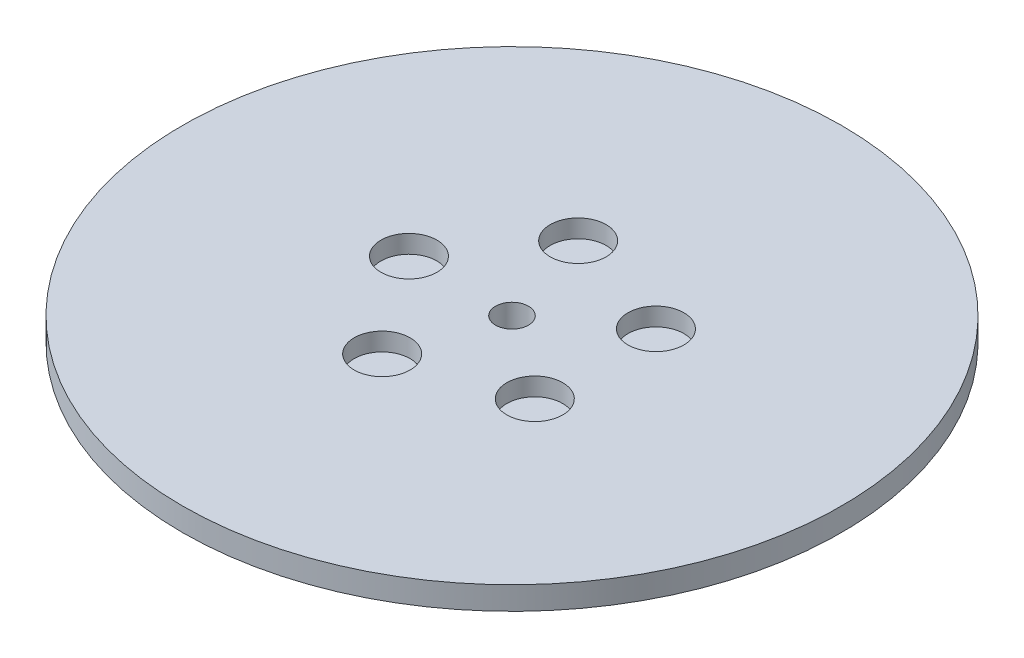
ISO-10303-21;
HEADER;
FILE_DESCRIPTION(('STEP AP214'),'2;1');
FILE_NAME('part.step','',(''),(''),'','','');
FILE_SCHEMA(('AUTOMOTIVE_DESIGN { 1 0 10303 214 1 1 1 1 }'));
ENDSEC;
DATA;
#1=APPLICATION_CONTEXT('core data for automotive mechanical design processes');
#2=APPLICATION_PROTOCOL_DEFINITION('international standard','automotive_design',2000,#1);
#3=PRODUCT_CONTEXT('',#1,'mechanical');
#4=PRODUCT('Part','Part','',(#3));
#5=PRODUCT_RELATED_PRODUCT_CATEGORY('part','',(#4));
#6=PRODUCT_DEFINITION_FORMATION('','',#4);
#7=PRODUCT_DEFINITION_CONTEXT('part definition',#1,'design');
#8=PRODUCT_DEFINITION('design','',#6,#7);
#9=PRODUCT_DEFINITION_SHAPE('','',#8);
#10=(LENGTH_UNIT() NAMED_UNIT(*) SI_UNIT(.MILLI.,.METRE.));
#11=(NAMED_UNIT(*) PLANE_ANGLE_UNIT() SI_UNIT($,.RADIAN.));
#12=(NAMED_UNIT(*) SI_UNIT($,.STERADIAN.) SOLID_ANGLE_UNIT());
#13=UNCERTAINTY_MEASURE_WITH_UNIT(LENGTH_MEASURE(1.E-05),#10,'distance_accuracy_value','');
#14=(GEOMETRIC_REPRESENTATION_CONTEXT(3) GLOBAL_UNCERTAINTY_ASSIGNED_CONTEXT((#13)) GLOBAL_UNIT_ASSIGNED_CONTEXT((#10,
#11,#12)) REPRESENTATION_CONTEXT('',''));
#15=CARTESIAN_POINT('',(0.,0.,0.));
#16=DIRECTION('',(0.,0.,1.));
#17=DIRECTION('',(1.,0.,0.));
#18=AXIS2_PLACEMENT_3D('',#15,#16,#17);
#19=CARTESIAN_POINT('',(0.,7.,0.));
#20=DIRECTION('',(0.,-1.,0.));
#21=DIRECTION('',(0.,0.,-1.));
#22=AXIS2_PLACEMENT_3D('',#19,#20,#21);
#23=CYLINDRICAL_SURFACE('',#22,100.);
#24=CARTESIAN_POINT('',(0.,7.,0.));
#25=DIRECTION('',(0.,1.,0.));
#26=DIRECTION('',(0.,0.,1.));
#27=AXIS2_PLACEMENT_3D('',#24,#25,#26);
#28=CIRCLE('',#27,100.);
#29=CARTESIAN_POINT('',(0.,7.,100.));
#30=VERTEX_POINT('',#29);
#31=EDGE_CURVE('E10',#30,#30,#28,.T.);
#32=ORIENTED_EDGE('',*,*,#31,.F.);
#33=EDGE_LOOP('',(#32));
#34=FACE_BOUND('',#33,.T.);
#35=CARTESIAN_POINT('',(0.,0.,0.));
#36=DIRECTION('',(0.,1.,0.));
#37=DIRECTION('',(0.,0.,1.));
#38=AXIS2_PLACEMENT_3D('',#35,#36,#37);
#39=CIRCLE('',#38,100.);
#40=CARTESIAN_POINT('',(0.,0.,100.));
#41=VERTEX_POINT('',#40);
#42=EDGE_CURVE('E37',#41,#41,#39,.T.);
#43=ORIENTED_EDGE('',*,*,#42,.T.);
#44=EDGE_LOOP('',(#43));
#45=FACE_BOUND('',#44,.T.);
#46=ADVANCED_FACE('F40',(#34,#45),#23,.T.);
#47=CARTESIAN_POINT('',(0.,7.,0.));
#48=DIRECTION('',(0.,1.,0.));
#49=DIRECTION('',(0.,0.,1.));
#50=AXIS2_PLACEMENT_3D('',#47,#48,#49);
#51=PLANE('',#50);
#52=CARTESIAN_POINT('',(-9.66223234586244,7.,-29.7372934232219));
#53=DIRECTION('',(0.,1.,0.));
#54=DIRECTION('',(-0.95105651629515,0.,0.309016994374958));
#55=AXIS2_PLACEMENT_3D('',#52,#53,#54);
#56=CIRCLE('',#55,8.47988604610912);
#57=CARTESIAN_POINT('',(-17.7270832274548,7.,-27.1168645246111));
#58=VERTEX_POINT('',#57);
#59=EDGE_CURVE('E70',#58,#58,#56,.T.);
#60=ORIENTED_EDGE('',*,*,#59,.F.);
#61=EDGE_LOOP('',(#60));
#62=FACE_BOUND('',#61,.T.);
#63=CARTESIAN_POINT('',(25.2960526886655,7.,-18.3786580689802));
#64=DIRECTION('',(0.,1.,0.));
#65=DIRECTION('',(-0.58778525229248,0.,-0.809016994374942));
#66=AXIS2_PLACEMENT_3D('',#63,#64,#65);
#67=CIRCLE('',#66,8.47988604610912);
#68=CARTESIAN_POINT('',(20.3117007296417,7.,-25.2390299906454));
#69=VERTEX_POINT('',#68);
#70=EDGE_CURVE('E71',#69,#69,#67,.T.);
#71=ORIENTED_EDGE('',*,*,#70,.F.);
#72=EDGE_LOOP('',(#71));
#73=FACE_BOUND('',#72,.T.);
#74=CARTESIAN_POINT('',(25.2960526886657,7.,18.3786580689798));
#75=DIRECTION('',(0.,1.,0.));
#76=DIRECTION('',(0.587785252292469,0.,-0.809016994374951));
#77=AXIS2_PLACEMENT_3D('',#74,#75,#76);
#78=CIRCLE('',#77,8.47988604610912);
#79=CARTESIAN_POINT('',(30.2804046476894,7.,11.5182861473145));
#80=VERTEX_POINT('',#79);
#81=EDGE_CURVE('E78',#80,#80,#78,.T.);
#82=ORIENTED_EDGE('',*,*,#81,.F.);
#83=EDGE_LOOP('',(#82));
#84=FACE_BOUND('',#83,.T.);
#85=CARTESIAN_POINT('',(-9.66223234586202,7.,29.7372934232221));
#86=DIRECTION('',(0.,1.,0.));
#87=DIRECTION('',(0.951056516295155,0.,0.309016994374945));
#88=AXIS2_PLACEMENT_3D('',#85,#86,#87);
#89=CIRCLE('',#88,8.47988604610912);
#90=CARTESIAN_POINT('',(-1.59738146426959,7.,32.3577223218327));
#91=VERTEX_POINT('',#90);
#92=EDGE_CURVE('E61',#91,#91,#89,.T.);
#93=ORIENTED_EDGE('',*,*,#92,.F.);
#94=EDGE_LOOP('',(#93));
#95=FACE_BOUND('',#94,.T.);
#96=CARTESIAN_POINT('',(-31.267640685607,7.,0.));
#97=DIRECTION('',(0.,1.,0.));
#98=DIRECTION('',(0.,0.,1.));
#99=AXIS2_PLACEMENT_3D('',#96,#97,#98);
#100=CIRCLE('',#99,8.47988604610912);
#101=CARTESIAN_POINT('',(-31.267640685607,7.,8.47988604610912));
#102=VERTEX_POINT('',#101);
#103=EDGE_CURVE('E54',#102,#102,#100,.T.);
#104=ORIENTED_EDGE('',*,*,#103,.F.);
#105=EDGE_LOOP('',(#104));
#106=FACE_BOUND('',#105,.T.);
#107=CARTESIAN_POINT('',(0.,7.,0.));
#108=DIRECTION('',(0.,1.,0.));
#109=DIRECTION('',(0.,0.,1.));
#110=AXIS2_PLACEMENT_3D('',#107,#108,#109);
#111=CIRCLE('',#110,5.);
#112=CARTESIAN_POINT('',(0.,7.,5.));
#113=VERTEX_POINT('',#112);
#114=EDGE_CURVE('E50',#113,#113,#111,.T.);
#115=ORIENTED_EDGE('',*,*,#114,.F.);
#116=EDGE_LOOP('',(#115));
#117=FACE_BOUND('',#116,.T.);
#118=ORIENTED_EDGE('',*,*,#31,.T.);
#119=EDGE_LOOP('',(#118));
#120=FACE_BOUND('',#119,.T.);
#121=ADVANCED_FACE('F94',(#62,#73,#84,#95,#106,#117,#120),#51,.T.);
#122=CARTESIAN_POINT('',(0.,0.,0.));
#123=DIRECTION('',(0.,1.,0.));
#124=DIRECTION('',(0.,0.,1.));
#125=AXIS2_PLACEMENT_3D('',#122,#123,#124);
#126=PLANE('',#125);
#127=CARTESIAN_POINT('',(0.,0.,0.));
#128=DIRECTION('',(0.,1.,0.));
#129=DIRECTION('',(0.,0.,1.));
#130=AXIS2_PLACEMENT_3D('',#127,#128,#129);
#131=CIRCLE('',#130,5.);
#132=CARTESIAN_POINT('',(0.,0.,5.));
#133=VERTEX_POINT('',#132);
#134=EDGE_CURVE('E47',#133,#133,#131,.T.);
#135=ORIENTED_EDGE('',*,*,#134,.T.);
#136=EDGE_LOOP('',(#135));
#137=FACE_BOUND('',#136,.T.);
#138=ORIENTED_EDGE('',*,*,#42,.F.);
#139=EDGE_LOOP('',(#138));
#140=FACE_BOUND('',#139,.T.);
#141=ADVANCED_FACE('F100',(#137,#140),#126,.F.);
#142=CARTESIAN_POINT('',(0.,7.,0.));
#143=DIRECTION('',(0.,-1.,0.));
#144=DIRECTION('',(0.,0.,-1.));
#145=AXIS2_PLACEMENT_3D('',#142,#143,#144);
#146=CYLINDRICAL_SURFACE('',#145,5.);
#147=ORIENTED_EDGE('',*,*,#114,.T.);
#148=EDGE_LOOP('',(#147));
#149=FACE_BOUND('',#148,.T.);
#150=ORIENTED_EDGE('',*,*,#134,.F.);
#151=EDGE_LOOP('',(#150));
#152=FACE_BOUND('',#151,.T.);
#153=ADVANCED_FACE('F106',(#149,#152),#146,.F.);
#154=CARTESIAN_POINT('',(-31.267640685607,1.51731609858439,0.));
#155=DIRECTION('',(0.,1.,0.));
#156=DIRECTION('',(0.,0.,1.));
#157=AXIS2_PLACEMENT_3D('',#154,#155,#156);
#158=CYLINDRICAL_SURFACE('',#157,8.47988604610912);
#159=CARTESIAN_POINT('',(-31.267640685607,1.51731609858439,0.));
#160=DIRECTION('',(0.,1.,0.));
#161=DIRECTION('',(0.,0.,1.));
#162=AXIS2_PLACEMENT_3D('',#159,#160,#161);
#163=CIRCLE('',#162,8.47988604610912);
#164=CARTESIAN_POINT('',(-31.267640685607,1.51731609858439,8.47988604610912));
#165=VERTEX_POINT('',#164);
#166=EDGE_CURVE('E55',#165,#165,#163,.T.);
#167=ORIENTED_EDGE('',*,*,#166,.F.);
#168=EDGE_LOOP('',(#167));
#169=FACE_BOUND('',#168,.T.);
#170=ORIENTED_EDGE('',*,*,#103,.T.);
#171=EDGE_LOOP('',(#170));
#172=FACE_BOUND('',#171,.T.);
#173=ADVANCED_FACE('F108',(#169,#172),#158,.F.);
#174=CARTESIAN_POINT('',(-31.267640685607,1.51731609858439,0.));
#175=DIRECTION('',(0.,1.,0.));
#176=DIRECTION('',(0.,0.,1.));
#177=AXIS2_PLACEMENT_3D('',#174,#175,#176);
#178=PLANE('',#177);
#179=ORIENTED_EDGE('',*,*,#166,.T.);
#180=EDGE_LOOP('',(#179));
#181=FACE_BOUND('',#180,.T.);
#182=ADVANCED_FACE('F138',(#181),#178,.T.);
#183=CARTESIAN_POINT('',(-9.66223234586202,1.51731609858439,29.7372934232221));
#184=DIRECTION('',(0.,1.,0.));
#185=DIRECTION('',(0.,0.,1.));
#186=AXIS2_PLACEMENT_3D('',#183,#184,#185);
#187=CYLINDRICAL_SURFACE('',#186,8.47988604610912);
#188=CARTESIAN_POINT('',(-9.66223234586202,1.51731609858439,29.7372934232221));
#189=DIRECTION('',(0.,1.,0.));
#190=DIRECTION('',(0.951056516295155,0.,0.309016994374945));
#191=AXIS2_PLACEMENT_3D('',#188,#189,#190);
#192=CIRCLE('',#191,8.47988604610912);
#193=CARTESIAN_POINT('',(-1.59738146426959,1.51731609858439,32.3577223218327));
#194=VERTEX_POINT('',#193);
#195=EDGE_CURVE('E59',#194,#194,#192,.T.);
#196=ORIENTED_EDGE('',*,*,#195,.F.);
#197=EDGE_LOOP('',(#196));
#198=FACE_BOUND('',#197,.T.);
#199=ORIENTED_EDGE('',*,*,#92,.T.);
#200=EDGE_LOOP('',(#199));
#201=FACE_BOUND('',#200,.T.);
#202=ADVANCED_FACE('F150',(#198,#201),#187,.F.);
#203=CARTESIAN_POINT('',(-9.66223234586202,1.51731609858439,29.7372934232221));
#204=DIRECTION('',(0.,1.,0.));
#205=DIRECTION('',(0.951056516295155,0.,0.309016994374945));
#206=AXIS2_PLACEMENT_3D('',#203,#204,#205);
#207=PLANE('',#206);
#208=ORIENTED_EDGE('',*,*,#195,.T.);
#209=EDGE_LOOP('',(#208));
#210=FACE_BOUND('',#209,.T.);
#211=ADVANCED_FACE('F89',(#210),#207,.T.);
#212=CARTESIAN_POINT('',(25.2960526886657,1.51731609858439,18.3786580689798));
#213=DIRECTION('',(0.,1.,0.));
#214=DIRECTION('',(0.,0.,1.));
#215=AXIS2_PLACEMENT_3D('',#212,#213,#214);
#216=CYLINDRICAL_SURFACE('',#215,8.47988604610912);
#217=CARTESIAN_POINT('',(25.2960526886657,1.51731609858439,18.3786580689798));
#218=DIRECTION('',(0.,1.,0.));
#219=DIRECTION('',(0.587785252292469,0.,-0.809016994374951));
#220=AXIS2_PLACEMENT_3D('',#217,#218,#219);
#221=CIRCLE('',#220,8.47988604610912);
#222=CARTESIAN_POINT('',(30.2804046476894,1.51731609858439,11.5182861473145));
#223=VERTEX_POINT('',#222);
#224=EDGE_CURVE('E63',#223,#223,#221,.T.);
#225=ORIENTED_EDGE('',*,*,#224,.F.);
#226=EDGE_LOOP('',(#225));
#227=FACE_BOUND('',#226,.T.);
#228=ORIENTED_EDGE('',*,*,#81,.T.);
#229=EDGE_LOOP('',(#228));
#230=FACE_BOUND('',#229,.T.);
#231=ADVANCED_FACE('F87',(#227,#230),#216,.F.);
#232=CARTESIAN_POINT('',(25.2960526886657,1.51731609858439,18.3786580689798));
#233=DIRECTION('',(0.,1.,0.));
#234=DIRECTION('',(0.587785252292469,0.,-0.809016994374951));
#235=AXIS2_PLACEMENT_3D('',#232,#233,#234);
#236=PLANE('',#235);
#237=ORIENTED_EDGE('',*,*,#224,.T.);
#238=EDGE_LOOP('',(#237));
#239=FACE_BOUND('',#238,.T.);
#240=ADVANCED_FACE('F84',(#239),#236,.T.);
#241=CARTESIAN_POINT('',(25.2960526886655,1.51731609858439,-18.3786580689802));
#242=DIRECTION('',(0.,1.,0.));
#243=DIRECTION('',(0.,0.,1.));
#244=AXIS2_PLACEMENT_3D('',#241,#242,#243);
#245=CYLINDRICAL_SURFACE('',#244,8.47988604610912);
#246=CARTESIAN_POINT('',(25.2960526886655,1.51731609858439,-18.3786580689802));
#247=DIRECTION('',(0.,1.,0.));
#248=DIRECTION('',(-0.58778525229248,0.,-0.809016994374942));
#249=AXIS2_PLACEMENT_3D('',#246,#247,#248);
#250=CIRCLE('',#249,8.47988604610912);
#251=CARTESIAN_POINT('',(20.3117007296417,1.51731609858439,-25.2390299906454));
#252=VERTEX_POINT('',#251);
#253=EDGE_CURVE('E76',#252,#252,#250,.T.);
#254=ORIENTED_EDGE('',*,*,#253,.F.);
#255=EDGE_LOOP('',(#254));
#256=FACE_BOUND('',#255,.T.);
#257=ORIENTED_EDGE('',*,*,#70,.T.);
#258=EDGE_LOOP('',(#257));
#259=FACE_BOUND('',#258,.T.);
#260=ADVANCED_FACE('F185',(#256,#259),#245,.F.);
#261=CARTESIAN_POINT('',(25.2960526886655,1.51731609858439,-18.3786580689802));
#262=DIRECTION('',(0.,1.,0.));
#263=DIRECTION('',(-0.58778525229248,0.,-0.809016994374942));
#264=AXIS2_PLACEMENT_3D('',#261,#262,#263);
#265=PLANE('',#264);
#266=ORIENTED_EDGE('',*,*,#253,.T.);
#267=EDGE_LOOP('',(#266));
#268=FACE_BOUND('',#267,.T.);
#269=ADVANCED_FACE('F189',(#268),#265,.T.);
#270=CARTESIAN_POINT('',(-9.66223234586244,1.51731609858439,-29.7372934232219));
#271=DIRECTION('',(0.,1.,0.));
#272=DIRECTION('',(0.,0.,1.));
#273=AXIS2_PLACEMENT_3D('',#270,#271,#272);
#274=CYLINDRICAL_SURFACE('',#273,8.47988604610912);
#275=CARTESIAN_POINT('',(-9.66223234586244,1.51731609858439,-29.7372934232219));
#276=DIRECTION('',(0.,1.,0.));
#277=DIRECTION('',(-0.95105651629515,0.,0.309016994374958));
#278=AXIS2_PLACEMENT_3D('',#275,#276,#277);
#279=CIRCLE('',#278,8.47988604610912);
#280=CARTESIAN_POINT('',(-17.7270832274548,1.51731609858439,-27.1168645246111));
#281=VERTEX_POINT('',#280);
#282=EDGE_CURVE('E69',#281,#281,#279,.T.);
#283=ORIENTED_EDGE('',*,*,#282,.F.);
#284=EDGE_LOOP('',(#283));
#285=FACE_BOUND('',#284,.T.);
#286=ORIENTED_EDGE('',*,*,#59,.T.);
#287=EDGE_LOOP('',(#286));
#288=FACE_BOUND('',#287,.T.);
#289=ADVANCED_FACE('F200',(#285,#288),#274,.F.);
#290=CARTESIAN_POINT('',(-9.66223234586244,1.51731609858439,-29.7372934232219));
#291=DIRECTION('',(0.,1.,0.));
#292=DIRECTION('',(-0.95105651629515,0.,0.309016994374958));
#293=AXIS2_PLACEMENT_3D('',#290,#291,#292);
#294=PLANE('',#293);
#295=ORIENTED_EDGE('',*,*,#282,.T.);
#296=EDGE_LOOP('',(#295));
#297=FACE_BOUND('',#296,.T.);
#298=ADVANCED_FACE('F208',(#297),#294,.T.);
#299=CLOSED_SHELL('',(#46,#121,#141,#153,#173,#182,#202,#211,#231,#240,#260,#269,#289,#298));
#300=MANIFOLD_SOLID_BREP('B2',#299);
#301=ADVANCED_BREP_SHAPE_REPRESENTATION('',(#18,#300),#14);
#302=SHAPE_DEFINITION_REPRESENTATION(#9,#301);
ENDSEC;
END-ISO-10303-21;
